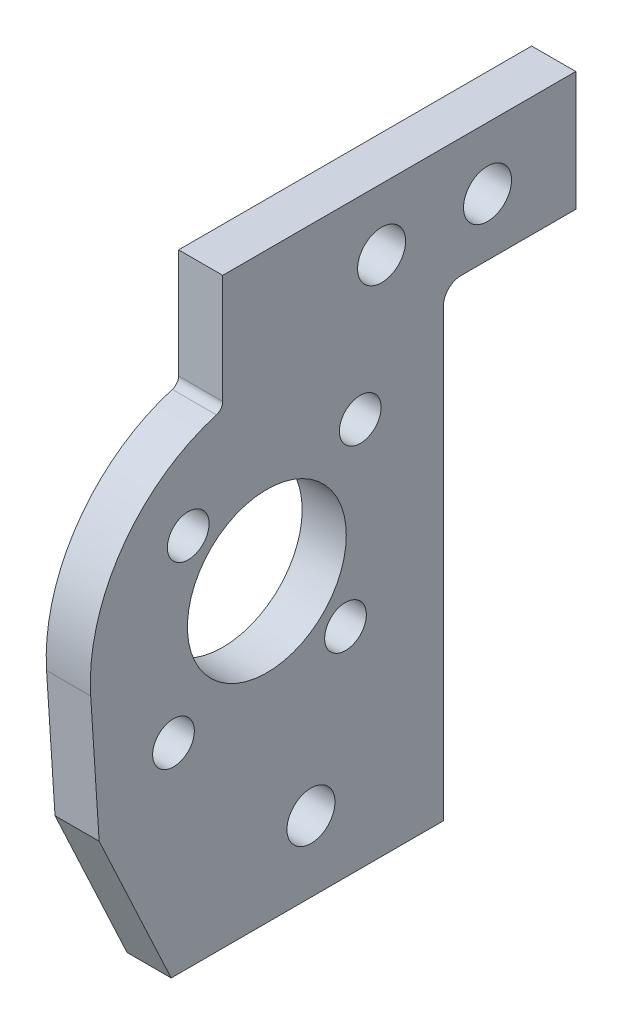
ISO-10303-21;
HEADER;
FILE_DESCRIPTION(('STEP AP214'),'2;1');
FILE_NAME('part.step','',(''),(''),'','','');
FILE_SCHEMA(('AUTOMOTIVE_DESIGN { 1 0 10303 214 1 1 1 1 }'));
ENDSEC;
DATA;
#1=APPLICATION_CONTEXT('core data for automotive mechanical design processes');
#2=APPLICATION_PROTOCOL_DEFINITION('international standard','automotive_design',2000,#1);
#3=PRODUCT_CONTEXT('',#1,'mechanical');
#4=PRODUCT('Part','Part','',(#3));
#5=PRODUCT_RELATED_PRODUCT_CATEGORY('part','',(#4));
#6=PRODUCT_DEFINITION_FORMATION('','',#4);
#7=PRODUCT_DEFINITION_CONTEXT('part definition',#1,'design');
#8=PRODUCT_DEFINITION('design','',#6,#7);
#9=PRODUCT_DEFINITION_SHAPE('','',#8);
#10=(LENGTH_UNIT() NAMED_UNIT(*) SI_UNIT(.MILLI.,.METRE.));
#11=(NAMED_UNIT(*) PLANE_ANGLE_UNIT() SI_UNIT($,.RADIAN.));
#12=(NAMED_UNIT(*) SI_UNIT($,.STERADIAN.) SOLID_ANGLE_UNIT());
#13=UNCERTAINTY_MEASURE_WITH_UNIT(LENGTH_MEASURE(1.E-05),#10,'distance_accuracy_value','');
#14=(GEOMETRIC_REPRESENTATION_CONTEXT(3) GLOBAL_UNCERTAINTY_ASSIGNED_CONTEXT((#13)) GLOBAL_UNIT_ASSIGNED_CONTEXT((#10,
#11,#12)) REPRESENTATION_CONTEXT('',''));
#15=CARTESIAN_POINT('',(0.,0.,0.));
#16=DIRECTION('',(0.,0.,1.));
#17=DIRECTION('',(1.,0.,0.));
#18=AXIS2_PLACEMENT_3D('',#15,#16,#17);
#19=CARTESIAN_POINT('',(12.7,33.3375,13.97));
#20=DIRECTION('',(-1.,0.,0.));
#21=DIRECTION('',(0.,0.,1.));
#22=AXIS2_PLACEMENT_3D('',#19,#20,#21);
#23=CYLINDRICAL_SURFACE('',#22,12.7);
#24=CARTESIAN_POINT('',(12.7,33.3375,13.97));
#25=DIRECTION('',(-1.,0.,0.));
#26=DIRECTION('',(0.,0.,1.));
#27=AXIS2_PLACEMENT_3D('',#24,#25,#26);
#28=CIRCLE('',#27,12.7);
#29=CARTESIAN_POINT('',(12.7,32.5131641528657,26.6432186287119));
#30=VERTEX_POINT('',#29);
#31=CARTESIAN_POINT('',(12.7,45.5080985632489,17.5985714285714));
#32=VERTEX_POINT('',#31);
#33=EDGE_CURVE('E128',#30,#32,#28,.T.);
#34=ORIENTED_EDGE('',*,*,#33,.T.);
#35=DIRECTION('',(-1.,0.,0.));
#36=VECTOR('',#35,1.);
#37=CARTESIAN_POINT('',(12.7,45.5080985632489,17.5985714285714));
#38=LINE('',#37,#36);
#39=CARTESIAN_POINT('',(9.525,45.5080985632489,17.5985714285714));
#40=VERTEX_POINT('',#39);
#41=EDGE_CURVE('E186',#32,#40,#38,.T.);
#42=ORIENTED_EDGE('',*,*,#41,.T.);
#43=CARTESIAN_POINT('',(9.525,33.3375,13.97));
#44=DIRECTION('',(-1.,0.,0.));
#45=DIRECTION('',(0.,0.,1.));
#46=AXIS2_PLACEMENT_3D('',#43,#44,#45);
#47=CIRCLE('',#46,12.7);
#48=CARTESIAN_POINT('',(9.525,32.5131641528657,26.6432186287119));
#49=VERTEX_POINT('',#48);
#50=EDGE_CURVE('E161',#49,#40,#47,.T.);
#51=ORIENTED_EDGE('',*,*,#50,.F.);
#52=DIRECTION('',(-1.,0.,0.));
#53=VECTOR('',#52,1.);
#54=CARTESIAN_POINT('',(12.7,32.5131641528657,26.6432186287119));
#55=LINE('',#54,#53);
#56=EDGE_CURVE('E184',#30,#49,#55,.T.);
#57=ORIENTED_EDGE('',*,*,#56,.F.);
#58=EDGE_LOOP('',(#34,#42,#51,#57));
#59=FACE_BOUND('',#58,.T.);
#60=ADVANCED_FACE('F35',(#59),#23,.T.);
#61=CARTESIAN_POINT('',(12.7,32.5131641528657,26.6432186287119));
#62=DIRECTION('',(0.,-0.0649083344200233,0.997891230607233));
#63=DIRECTION('',(0.,-0.997891230607233,-0.0649083344200233));
#64=AXIS2_PLACEMENT_3D('',#61,#62,#63);
#65=PLANE('',#64);
#66=DIRECTION('',(0.,0.997891230607233,0.0649083344200233));
#67=VECTOR('',#66,1.);
#68=CARTESIAN_POINT('',(9.525,32.5131641528657,26.6432186287119));
#69=LINE('',#68,#67);
#70=CARTESIAN_POINT('',(9.525,23.1625,26.035));
#71=VERTEX_POINT('',#70);
#72=EDGE_CURVE('E181',#71,#49,#69,.T.);
#73=ORIENTED_EDGE('',*,*,#72,.F.);
#74=DIRECTION('',(-1.,0.,0.));
#75=VECTOR('',#74,1.);
#76=CARTESIAN_POINT('',(12.7,23.1625,26.035));
#77=LINE('',#76,#75);
#78=CARTESIAN_POINT('',(12.7,23.1625,26.035));
#79=VERTEX_POINT('',#78);
#80=EDGE_CURVE('E187',#79,#71,#77,.T.);
#81=ORIENTED_EDGE('',*,*,#80,.F.);
#82=DIRECTION('',(0.,0.997891230607233,0.0649083344200233));
#83=VECTOR('',#82,1.);
#84=CARTESIAN_POINT('',(12.7,32.5131641528657,26.6432186287119));
#85=LINE('',#84,#83);
#86=EDGE_CURVE('E136',#79,#30,#85,.T.);
#87=ORIENTED_EDGE('',*,*,#86,.T.);
#88=ORIENTED_EDGE('',*,*,#56,.T.);
#89=EDGE_LOOP('',(#73,#81,#87,#88));
#90=FACE_BOUND('',#89,.T.);
#91=ADVANCED_FACE('F229',(#90),#65,.T.);
#92=CARTESIAN_POINT('',(12.7,23.1625,26.035));
#93=DIRECTION('',(0.,-0.422618261740703,0.906307787036648));
#94=DIRECTION('',(0.,-0.906307787036648,-0.422618261740703));
#95=AXIS2_PLACEMENT_3D('',#92,#93,#94);
#96=PLANE('',#95);
#97=DIRECTION('',(0.,0.906307787036648,0.422618261740703));
#98=VECTOR('',#97,1.);
#99=CARTESIAN_POINT('',(9.525,23.1625,26.035));
#100=LINE('',#99,#98);
#101=CARTESIAN_POINT('',(9.525,12.05,20.8531561487525));
#102=VERTEX_POINT('',#101);
#103=EDGE_CURVE('E178',#102,#71,#100,.T.);
#104=ORIENTED_EDGE('',*,*,#103,.F.);
#105=DIRECTION('',(-1.,0.,0.));
#106=VECTOR('',#105,1.);
#107=CARTESIAN_POINT('',(12.7,12.05,20.8531561487525));
#108=LINE('',#107,#106);
#109=CARTESIAN_POINT('',(12.7,12.05,20.8531561487525));
#110=VERTEX_POINT('',#109);
#111=EDGE_CURVE('E189',#110,#102,#108,.T.);
#112=ORIENTED_EDGE('',*,*,#111,.F.);
#113=DIRECTION('',(0.,0.906307787036648,0.422618261740703));
#114=VECTOR('',#113,1.);
#115=CARTESIAN_POINT('',(12.7,23.1625,26.035));
#116=LINE('',#115,#114);
#117=EDGE_CURVE('E156',#110,#79,#116,.T.);
#118=ORIENTED_EDGE('',*,*,#117,.T.);
#119=ORIENTED_EDGE('',*,*,#80,.T.);
#120=EDGE_LOOP('',(#104,#112,#118,#119));
#121=FACE_BOUND('',#120,.T.);
#122=ADVANCED_FACE('F235',(#121),#96,.T.);
#123=CARTESIAN_POINT('',(12.7,12.05,1.27000000000001));
#124=DIRECTION('',(0.,-1.,0.));
#125=DIRECTION('',(0.,0.,-1.));
#126=AXIS2_PLACEMENT_3D('',#123,#124,#125);
#127=PLANE('',#126);
#128=DIRECTION('',(0.,0.,1.));
#129=VECTOR('',#128,1.);
#130=CARTESIAN_POINT('',(9.525,12.05,1.27000000000001));
#131=LINE('',#130,#129);
#132=CARTESIAN_POINT('',(9.525,12.05,1.27000000000001));
#133=VERTEX_POINT('',#132);
#134=EDGE_CURVE('E175',#133,#102,#131,.T.);
#135=ORIENTED_EDGE('',*,*,#134,.F.);
#136=DIRECTION('',(-1.,0.,0.));
#137=VECTOR('',#136,1.);
#138=CARTESIAN_POINT('',(12.7,12.05,1.27000000000001));
#139=LINE('',#138,#137);
#140=CARTESIAN_POINT('',(12.7,12.05,1.27000000000001));
#141=VERTEX_POINT('',#140);
#142=EDGE_CURVE('E191',#141,#133,#139,.T.);
#143=ORIENTED_EDGE('',*,*,#142,.F.);
#144=DIRECTION('',(0.,0.,1.));
#145=VECTOR('',#144,1.);
#146=CARTESIAN_POINT('',(12.7,12.05,1.27000000000001));
#147=LINE('',#146,#145);
#148=EDGE_CURVE('E153',#141,#110,#147,.T.);
#149=ORIENTED_EDGE('',*,*,#148,.T.);
#150=ORIENTED_EDGE('',*,*,#111,.T.);
#151=EDGE_LOOP('',(#135,#143,#149,#150));
#152=FACE_BOUND('',#151,.T.);
#153=ADVANCED_FACE('F251',(#152),#127,.T.);
#154=CARTESIAN_POINT('',(12.7,12.05,1.27000000000001));
#155=DIRECTION('',(0.,0.,-1.));
#156=DIRECTION('',(0.,1.,0.));
#157=AXIS2_PLACEMENT_3D('',#154,#155,#156);
#158=PLANE('',#157);
#159=DIRECTION('',(0.,-1.,0.));
#160=VECTOR('',#159,1.);
#161=CARTESIAN_POINT('',(9.525,12.05,1.27000000000001));
#162=LINE('',#161,#160);
#163=CARTESIAN_POINT('',(9.525,44.1175,1.27000000000001));
#164=VERTEX_POINT('',#163);
#165=EDGE_CURVE('E173',#164,#133,#162,.T.);
#166=ORIENTED_EDGE('',*,*,#165,.F.);
#167=DIRECTION('',(-1.,0.,0.));
#168=VECTOR('',#167,1.);
#169=CARTESIAN_POINT('',(12.7,44.1175,1.27000000000001));
#170=LINE('',#169,#168);
#171=CARTESIAN_POINT('',(12.7,44.1175,1.27));
#172=VERTEX_POINT('',#171);
#173=EDGE_CURVE('E50',#164,#172,#170,.F.);
#174=ORIENTED_EDGE('',*,*,#173,.T.);
#175=DIRECTION('',(0.,-1.,0.));
#176=VECTOR('',#175,1.);
#177=CARTESIAN_POINT('',(12.7,45.3875,1.27));
#178=LINE('',#177,#176);
#179=EDGE_CURVE('E151',#172,#141,#178,.T.);
#180=ORIENTED_EDGE('',*,*,#179,.T.);
#181=ORIENTED_EDGE('',*,*,#142,.T.);
#182=EDGE_LOOP('',(#166,#174,#180,#181));
#183=FACE_BOUND('',#182,.T.);
#184=ADVANCED_FACE('F248',(#183),#158,.T.);
#185=CARTESIAN_POINT('',(12.7,45.3875,-8.25499999999999));
#186=DIRECTION('',(0.,-1.,0.));
#187=DIRECTION('',(0.,0.,-1.));
#188=AXIS2_PLACEMENT_3D('',#185,#186,#187);
#189=PLANE('',#188);
#190=DIRECTION('',(0.,0.,1.));
#191=VECTOR('',#190,1.);
#192=CARTESIAN_POINT('',(12.7,45.3875,-8.25499999999999));
#193=LINE('',#192,#191);
#194=CARTESIAN_POINT('',(12.7,45.3875,-8.25499999999999));
#195=VERTEX_POINT('',#194);
#196=CARTESIAN_POINT('',(12.7,45.3875,0.));
#197=VERTEX_POINT('',#196);
#198=EDGE_CURVE('E145',#195,#197,#193,.T.);
#199=ORIENTED_EDGE('',*,*,#198,.T.);
#200=DIRECTION('',(-1.,0.,0.));
#201=VECTOR('',#200,1.);
#202=CARTESIAN_POINT('',(9.525,45.3875,0.));
#203=LINE('',#202,#201);
#204=CARTESIAN_POINT('',(9.525,45.3875,0.));
#205=VERTEX_POINT('',#204);
#206=EDGE_CURVE('E207',#197,#205,#203,.T.);
#207=ORIENTED_EDGE('',*,*,#206,.T.);
#208=DIRECTION('',(0.,0.,1.));
#209=VECTOR('',#208,1.);
#210=CARTESIAN_POINT('',(9.525,45.3875,-8.25499999999999));
#211=LINE('',#210,#209);
#212=CARTESIAN_POINT('',(9.525,45.3875,-8.25499999999999));
#213=VERTEX_POINT('',#212);
#214=EDGE_CURVE('E171',#213,#205,#211,.T.);
#215=ORIENTED_EDGE('',*,*,#214,.F.);
#216=DIRECTION('',(-1.,0.,0.));
#217=VECTOR('',#216,1.);
#218=CARTESIAN_POINT('',(12.7,45.3875,-8.25499999999999));
#219=LINE('',#218,#217);
#220=EDGE_CURVE('E194',#195,#213,#219,.T.);
#221=ORIENTED_EDGE('',*,*,#220,.F.);
#222=EDGE_LOOP('',(#199,#207,#215,#221));
#223=FACE_BOUND('',#222,.T.);
#224=ADVANCED_FACE('F213',(#223),#189,.T.);
#225=CARTESIAN_POINT('',(12.7,53.975,-8.255));
#226=DIRECTION('',(0.,0.,-1.));
#227=DIRECTION('',(0.,1.,0.));
#228=AXIS2_PLACEMENT_3D('',#225,#226,#227);
#229=PLANE('',#228);
#230=DIRECTION('',(0.,-1.,0.));
#231=VECTOR('',#230,1.);
#232=CARTESIAN_POINT('',(9.525,53.975,-8.255));
#233=LINE('',#232,#231);
#234=CARTESIAN_POINT('',(9.525,53.975,-8.255));
#235=VERTEX_POINT('',#234);
#236=EDGE_CURVE('E168',#235,#213,#233,.T.);
#237=ORIENTED_EDGE('',*,*,#236,.F.);
#238=DIRECTION('',(-1.,0.,0.));
#239=VECTOR('',#238,1.);
#240=CARTESIAN_POINT('',(12.7,53.975,-8.255));
#241=LINE('',#240,#239);
#242=CARTESIAN_POINT('',(12.7,53.975,-8.255));
#243=VERTEX_POINT('',#242);
#244=EDGE_CURVE('E135',#243,#235,#241,.T.);
#245=ORIENTED_EDGE('',*,*,#244,.F.);
#246=DIRECTION('',(0.,-1.,0.));
#247=VECTOR('',#246,1.);
#248=CARTESIAN_POINT('',(12.7,53.975,-8.255));
#249=LINE('',#248,#247);
#250=EDGE_CURVE('E143',#243,#195,#249,.T.);
#251=ORIENTED_EDGE('',*,*,#250,.T.);
#252=ORIENTED_EDGE('',*,*,#220,.T.);
#253=EDGE_LOOP('',(#237,#245,#251,#252));
#254=FACE_BOUND('',#253,.T.);
#255=ADVANCED_FACE('F219',(#254),#229,.T.);
#256=CARTESIAN_POINT('',(12.7,53.975,17.145));
#257=DIRECTION('',(0.,1.,0.));
#258=DIRECTION('',(0.,0.,1.));
#259=AXIS2_PLACEMENT_3D('',#256,#257,#258);
#260=PLANE('',#259);
#261=DIRECTION('',(0.,0.,-1.));
#262=VECTOR('',#261,1.);
#263=CARTESIAN_POINT('',(9.525,53.975,17.145));
#264=LINE('',#263,#262);
#265=CARTESIAN_POINT('',(9.525,53.975,17.145));
#266=VERTEX_POINT('',#265);
#267=EDGE_CURVE('E134',#266,#235,#264,.T.);
#268=ORIENTED_EDGE('',*,*,#267,.F.);
#269=DIRECTION('',(-1.,0.,0.));
#270=VECTOR('',#269,1.);
#271=CARTESIAN_POINT('',(12.7,53.975,17.145));
#272=LINE('',#271,#270);
#273=CARTESIAN_POINT('',(12.7,53.975,17.145));
#274=VERTEX_POINT('',#273);
#275=EDGE_CURVE('E120',#274,#266,#272,.T.);
#276=ORIENTED_EDGE('',*,*,#275,.F.);
#277=DIRECTION('',(0.,0.,-1.));
#278=VECTOR('',#277,1.);
#279=CARTESIAN_POINT('',(12.7,53.975,17.145));
#280=LINE('',#279,#278);
#281=EDGE_CURVE('E127',#274,#243,#280,.T.);
#282=ORIENTED_EDGE('',*,*,#281,.T.);
#283=ORIENTED_EDGE('',*,*,#244,.T.);
#284=EDGE_LOOP('',(#268,#276,#282,#283));
#285=FACE_BOUND('',#284,.T.);
#286=ADVANCED_FACE('F132',(#285),#260,.T.);
#287=CARTESIAN_POINT('',(12.7,45.6342221242085,17.145));
#288=DIRECTION('',(0.,0.,1.));
#289=DIRECTION('',(1.,0.,0.));
#290=AXIS2_PLACEMENT_3D('',#287,#288,#289);
#291=PLANE('',#290);
#292=DIRECTION('',(0.,1.,0.));
#293=VECTOR('',#292,1.);
#294=CARTESIAN_POINT('',(9.525,45.6342221242085,17.145));
#295=LINE('',#294,#293);
#296=CARTESIAN_POINT('',(9.525,46.1166284914113,17.145));
#297=VERTEX_POINT('',#296);
#298=EDGE_CURVE('E164',#297,#266,#295,.T.);
#299=ORIENTED_EDGE('',*,*,#298,.F.);
#300=DIRECTION('',(1.,0.,0.));
#301=VECTOR('',#300,1.);
#302=CARTESIAN_POINT('',(12.7,46.1166284914113,17.145));
#303=LINE('',#302,#301);
#304=CARTESIAN_POINT('',(12.7,46.1166284914113,17.145));
#305=VERTEX_POINT('',#304);
#306=EDGE_CURVE('E123',#297,#305,#303,.T.);
#307=ORIENTED_EDGE('',*,*,#306,.T.);
#308=DIRECTION('',(0.,1.,0.));
#309=VECTOR('',#308,1.);
#310=CARTESIAN_POINT('',(12.7,45.6342221242085,17.145));
#311=LINE('',#310,#309);
#312=EDGE_CURVE('E116',#305,#274,#311,.T.);
#313=ORIENTED_EDGE('',*,*,#312,.T.);
#314=ORIENTED_EDGE('',*,*,#275,.T.);
#315=EDGE_LOOP('',(#299,#307,#313,#314));
#316=FACE_BOUND('',#315,.T.);
#317=ADVANCED_FACE('F119',(#316),#291,.T.);
#318=CARTESIAN_POINT('',(12.7,33.3375,13.97));
#319=DIRECTION('',(-1.,0.,0.));
#320=DIRECTION('',(0.,0.,1.));
#321=AXIS2_PLACEMENT_3D('',#318,#319,#320);
#322=PLANE('',#321);
#323=CARTESIAN_POINT('',(12.7,17.13,10.795));
#324=DIRECTION('',(-1.,0.,0.));
#325=DIRECTION('',(0.,0.,1.));
#326=AXIS2_PLACEMENT_3D('',#323,#324,#325);
#327=CIRCLE('',#326,1.7272);
#328=CARTESIAN_POINT('',(12.7,17.13,12.5222));
#329=VERTEX_POINT('',#328);
#330=EDGE_CURVE('E302',#329,#329,#327,.T.);
#331=ORIENTED_EDGE('',*,*,#330,.T.);
#332=EDGE_LOOP('',(#331));
#333=FACE_BOUND('',#332,.T.);
#334=CARTESIAN_POINT('',(12.7,49.53,-1.90499999999999));
#335=DIRECTION('',(-1.,0.,0.));
#336=DIRECTION('',(0.,0.,1.));
#337=AXIS2_PLACEMENT_3D('',#334,#335,#336);
#338=CIRCLE('',#337,1.72720000000001);
#339=CARTESIAN_POINT('',(12.7,49.53,-0.177799999999987));
#340=VERTEX_POINT('',#339);
#341=EDGE_CURVE('E304',#340,#340,#338,.T.);
#342=ORIENTED_EDGE('',*,*,#341,.T.);
#343=EDGE_LOOP('',(#342));
#344=FACE_BOUND('',#343,.T.);
#345=CARTESIAN_POINT('',(12.7,49.53,5.71500000000001));
#346=DIRECTION('',(-1.,0.,0.));
#347=DIRECTION('',(0.,0.,1.));
#348=AXIS2_PLACEMENT_3D('',#345,#346,#347);
#349=CIRCLE('',#348,1.72720000000001);
#350=CARTESIAN_POINT('',(12.7,49.53,7.44220000000001));
#351=VERTEX_POINT('',#350);
#352=EDGE_CURVE('E310',#351,#351,#349,.T.);
#353=ORIENTED_EDGE('',*,*,#352,.T.);
#354=EDGE_LOOP('',(#353));
#355=FACE_BOUND('',#354,.T.);
#356=CARTESIAN_POINT('',(12.7,26.6199855787278,20.6875144212722));
#357=DIRECTION('',(-1.,0.,0.));
#358=DIRECTION('',(0.,0.,1.));
#359=AXIS2_PLACEMENT_3D('',#356,#357,#358);
#360=CIRCLE('',#359,1.49999999999994);
#361=CARTESIAN_POINT('',(12.7,26.6199855787278,22.1875144212722));
#362=VERTEX_POINT('',#361);
#363=EDGE_CURVE('E317',#362,#362,#360,.F.);
#364=ORIENTED_EDGE('',*,*,#363,.F.);
#365=EDGE_LOOP('',(#364));
#366=FACE_BOUND('',#365,.T.);
#367=CARTESIAN_POINT('',(12.7,38.9943542494923,19.6268542494924));
#368=DIRECTION('',(-1.,0.,0.));
#369=DIRECTION('',(0.,0.,1.));
#370=AXIS2_PLACEMENT_3D('',#367,#368,#369);
#371=CIRCLE('',#370,1.49999999999999);
#372=CARTESIAN_POINT('',(12.7,38.9943542494923,21.1268542494924));
#373=VERTEX_POINT('',#372);
#374=EDGE_CURVE('E318',#373,#373,#371,.F.);
#375=ORIENTED_EDGE('',*,*,#374,.F.);
#376=EDGE_LOOP('',(#375));
#377=FACE_BOUND('',#376,.T.);
#378=CARTESIAN_POINT('',(12.7,40.0550144212723,7.2524855787279));
#379=DIRECTION('',(-1.,0.,0.));
#380=DIRECTION('',(0.,0.,1.));
#381=AXIS2_PLACEMENT_3D('',#378,#379,#380);
#382=CIRCLE('',#381,1.49999999999993);
#383=CARTESIAN_POINT('',(12.7,40.0550144212723,8.75248557872783));
#384=VERTEX_POINT('',#383);
#385=EDGE_CURVE('E324',#384,#384,#382,.F.);
#386=ORIENTED_EDGE('',*,*,#385,.F.);
#387=EDGE_LOOP('',(#386));
#388=FACE_BOUND('',#387,.T.);
#389=CARTESIAN_POINT('',(12.7,27.6806457505076,8.3131457505076));
#390=DIRECTION('',(-1.,0.,0.));
#391=DIRECTION('',(0.,0.,1.));
#392=AXIS2_PLACEMENT_3D('',#389,#390,#391);
#393=CIRCLE('',#392,1.5);
#394=CARTESIAN_POINT('',(12.7,27.6806457505076,9.81314575050759));
#395=VERTEX_POINT('',#394);
#396=EDGE_CURVE('E307',#395,#395,#393,.F.);
#397=ORIENTED_EDGE('',*,*,#396,.F.);
#398=EDGE_LOOP('',(#397));
#399=FACE_BOUND('',#398,.T.);
#400=CARTESIAN_POINT('',(12.7,33.3375,13.97));
#401=DIRECTION('',(1.,0.,0.));
#402=DIRECTION('',(0.,0.,-1.));
#403=AXIS2_PLACEMENT_3D('',#400,#401,#402);
#404=CIRCLE('',#403,5.715);
#405=CARTESIAN_POINT('',(12.7,33.3375,8.25500000000001));
#406=VERTEX_POINT('',#405);
#407=EDGE_CURVE('E199',#406,#406,#404,.T.);
#408=ORIENTED_EDGE('',*,*,#407,.F.);
#409=EDGE_LOOP('',(#408));
#410=FACE_BOUND('',#409,.T.);
#411=ORIENTED_EDGE('',*,*,#33,.F.);
#412=ORIENTED_EDGE('',*,*,#86,.F.);
#413=ORIENTED_EDGE('',*,*,#117,.F.);
#414=ORIENTED_EDGE('',*,*,#148,.F.);
#415=ORIENTED_EDGE('',*,*,#179,.F.);
#416=CARTESIAN_POINT('',(12.7,44.1175,0.));
#417=DIRECTION('',(-1.,0.,0.));
#418=DIRECTION('',(0.,0.,1.));
#419=AXIS2_PLACEMENT_3D('',#416,#417,#418);
#420=CIRCLE('',#419,1.27);
#421=EDGE_CURVE('E11',#172,#197,#420,.T.);
#422=ORIENTED_EDGE('',*,*,#421,.T.);
#423=ORIENTED_EDGE('',*,*,#198,.F.);
#424=ORIENTED_EDGE('',*,*,#250,.F.);
#425=ORIENTED_EDGE('',*,*,#281,.F.);
#426=ORIENTED_EDGE('',*,*,#312,.F.);
#427=CARTESIAN_POINT('',(12.7,46.1166284914113,17.78));
#428=DIRECTION('',(-1.,0.,0.));
#429=DIRECTION('',(0.,0.,1.));
#430=AXIS2_PLACEMENT_3D('',#427,#428,#429);
#431=CIRCLE('',#430,0.635);
#432=EDGE_CURVE('E205',#305,#32,#431,.T.);
#433=ORIENTED_EDGE('',*,*,#432,.T.);
#434=EDGE_LOOP('',(#411,#412,#413,#414,#415,#422,#423,#424,#425,#426,#433));
#435=FACE_BOUND('',#434,.T.);
#436=ADVANCED_FACE('F140',(#333,#344,#355,#366,#377,#388,#399,#410,#435),#322,.F.);
#437=CARTESIAN_POINT('',(9.525,33.3375,13.97));
#438=DIRECTION('',(-1.,0.,0.));
#439=DIRECTION('',(0.,0.,1.));
#440=AXIS2_PLACEMENT_3D('',#437,#438,#439);
#441=PLANE('',#440);
#442=CARTESIAN_POINT('',(9.525,17.13,10.795));
#443=DIRECTION('',(-1.,0.,0.));
#444=DIRECTION('',(0.,0.,1.));
#445=AXIS2_PLACEMENT_3D('',#442,#443,#444);
#446=CIRCLE('',#445,1.7272);
#447=CARTESIAN_POINT('',(9.525,17.13,12.5222));
#448=VERTEX_POINT('',#447);
#449=EDGE_CURVE('E299',#448,#448,#446,.T.);
#450=ORIENTED_EDGE('',*,*,#449,.F.);
#451=EDGE_LOOP('',(#450));
#452=FACE_BOUND('',#451,.T.);
#453=CARTESIAN_POINT('',(9.525,49.53,-1.90499999999999));
#454=DIRECTION('',(-1.,0.,0.));
#455=DIRECTION('',(0.,0.,1.));
#456=AXIS2_PLACEMENT_3D('',#453,#454,#455);
#457=CIRCLE('',#456,1.72720000000001);
#458=CARTESIAN_POINT('',(9.525,49.53,-0.177799999999987));
#459=VERTEX_POINT('',#458);
#460=EDGE_CURVE('E373',#459,#459,#457,.T.);
#461=ORIENTED_EDGE('',*,*,#460,.F.);
#462=EDGE_LOOP('',(#461));
#463=FACE_BOUND('',#462,.T.);
#464=CARTESIAN_POINT('',(9.525,49.53,5.71500000000001));
#465=DIRECTION('',(-1.,0.,0.));
#466=DIRECTION('',(0.,0.,1.));
#467=AXIS2_PLACEMENT_3D('',#464,#465,#466);
#468=CIRCLE('',#467,1.72720000000001);
#469=CARTESIAN_POINT('',(9.525,49.53,7.44220000000001));
#470=VERTEX_POINT('',#469);
#471=EDGE_CURVE('E370',#470,#470,#468,.T.);
#472=ORIENTED_EDGE('',*,*,#471,.F.);
#473=EDGE_LOOP('',(#472));
#474=FACE_BOUND('',#473,.T.);
#475=CARTESIAN_POINT('',(9.525,26.6199855787278,20.6875144212722));
#476=DIRECTION('',(-1.,0.,0.));
#477=DIRECTION('',(0.,0.,1.));
#478=AXIS2_PLACEMENT_3D('',#475,#476,#477);
#479=CIRCLE('',#478,1.49999999999994);
#480=CARTESIAN_POINT('',(9.525,26.6199855787278,22.1875144212722));
#481=VERTEX_POINT('',#480);
#482=EDGE_CURVE('E314',#481,#481,#479,.T.);
#483=ORIENTED_EDGE('',*,*,#482,.F.);
#484=EDGE_LOOP('',(#483));
#485=FACE_BOUND('',#484,.T.);
#486=CARTESIAN_POINT('',(9.525,38.9943542494923,19.6268542494924));
#487=DIRECTION('',(-1.,0.,0.));
#488=DIRECTION('',(0.,0.,1.));
#489=AXIS2_PLACEMENT_3D('',#486,#487,#488);
#490=CIRCLE('',#489,1.49999999999999);
#491=CARTESIAN_POINT('',(9.525,38.9943542494923,21.1268542494924));
#492=VERTEX_POINT('',#491);
#493=EDGE_CURVE('E321',#492,#492,#490,.T.);
#494=ORIENTED_EDGE('',*,*,#493,.F.);
#495=EDGE_LOOP('',(#494));
#496=FACE_BOUND('',#495,.T.);
#497=CARTESIAN_POINT('',(9.525,40.0550144212723,7.2524855787279));
#498=DIRECTION('',(-1.,0.,0.));
#499=DIRECTION('',(0.,0.,1.));
#500=AXIS2_PLACEMENT_3D('',#497,#498,#499);
#501=CIRCLE('',#500,1.49999999999993);
#502=CARTESIAN_POINT('',(9.525,40.0550144212723,8.75248557872783));
#503=VERTEX_POINT('',#502);
#504=EDGE_CURVE('E327',#503,#503,#501,.T.);
#505=ORIENTED_EDGE('',*,*,#504,.F.);
#506=EDGE_LOOP('',(#505));
#507=FACE_BOUND('',#506,.T.);
#508=CARTESIAN_POINT('',(9.525,27.6806457505076,8.3131457505076));
#509=DIRECTION('',(-1.,0.,0.));
#510=DIRECTION('',(0.,0.,1.));
#511=AXIS2_PLACEMENT_3D('',#508,#509,#510);
#512=CIRCLE('',#511,1.5);
#513=CARTESIAN_POINT('',(9.525,27.6806457505076,9.81314575050759));
#514=VERTEX_POINT('',#513);
#515=EDGE_CURVE('E303',#514,#514,#512,.T.);
#516=ORIENTED_EDGE('',*,*,#515,.F.);
#517=EDGE_LOOP('',(#516));
#518=FACE_BOUND('',#517,.T.);
#519=CARTESIAN_POINT('',(9.525,33.3375,13.97));
#520=DIRECTION('',(-1.,0.,0.));
#521=DIRECTION('',(0.,0.,1.));
#522=AXIS2_PLACEMENT_3D('',#519,#520,#521);
#523=CIRCLE('',#522,5.715);
#524=CARTESIAN_POINT('',(9.525,33.3375,19.685));
#525=VERTEX_POINT('',#524);
#526=EDGE_CURVE('E165',#525,#525,#523,.T.);
#527=ORIENTED_EDGE('',*,*,#526,.F.);
#528=EDGE_LOOP('',(#527));
#529=FACE_BOUND('',#528,.T.);
#530=ORIENTED_EDGE('',*,*,#50,.T.);
#531=CARTESIAN_POINT('',(9.525,46.1166284914113,17.78));
#532=DIRECTION('',(-1.,0.,0.));
#533=DIRECTION('',(0.,0.,1.));
#534=AXIS2_PLACEMENT_3D('',#531,#532,#533);
#535=CIRCLE('',#534,0.635);
#536=EDGE_CURVE('E203',#40,#297,#535,.F.);
#537=ORIENTED_EDGE('',*,*,#536,.T.);
#538=ORIENTED_EDGE('',*,*,#298,.T.);
#539=ORIENTED_EDGE('',*,*,#267,.T.);
#540=ORIENTED_EDGE('',*,*,#236,.T.);
#541=ORIENTED_EDGE('',*,*,#214,.T.);
#542=CARTESIAN_POINT('',(9.525,44.1175,0.));
#543=DIRECTION('',(-1.,0.,0.));
#544=DIRECTION('',(0.,0.,1.));
#545=AXIS2_PLACEMENT_3D('',#542,#543,#544);
#546=CIRCLE('',#545,1.27);
#547=EDGE_CURVE('E43',#205,#164,#546,.F.);
#548=ORIENTED_EDGE('',*,*,#547,.T.);
#549=ORIENTED_EDGE('',*,*,#165,.T.);
#550=ORIENTED_EDGE('',*,*,#134,.T.);
#551=ORIENTED_EDGE('',*,*,#103,.T.);
#552=ORIENTED_EDGE('',*,*,#72,.T.);
#553=EDGE_LOOP('',(#530,#537,#538,#539,#540,#541,#548,#549,#550,#551,#552));
#554=FACE_BOUND('',#553,.T.);
#555=ADVANCED_FACE('F216',(#452,#463,#474,#485,#496,#507,#518,#529,#554),#441,.T.);
#556=CARTESIAN_POINT('',(0.,33.3375,13.97));
#557=DIRECTION('',(1.,0.,0.));
#558=DIRECTION('',(0.,0.,-1.));
#559=AXIS2_PLACEMENT_3D('',#556,#557,#558);
#560=CYLINDRICAL_SURFACE('',#559,5.715);
#561=ORIENTED_EDGE('',*,*,#526,.T.);
#562=EDGE_LOOP('',(#561));
#563=FACE_BOUND('',#562,.T.);
#564=ORIENTED_EDGE('',*,*,#407,.T.);
#565=EDGE_LOOP('',(#564));
#566=FACE_BOUND('',#565,.T.);
#567=ADVANCED_FACE('F260',(#563,#566),#560,.F.);
#568=CARTESIAN_POINT('',(32.501,27.6806457505076,8.3131457505076));
#569=DIRECTION('',(-1.,0.,0.));
#570=DIRECTION('',(0.,0.,1.));
#571=AXIS2_PLACEMENT_3D('',#568,#569,#570);
#572=CYLINDRICAL_SURFACE('',#571,1.5);
#573=ORIENTED_EDGE('',*,*,#515,.T.);
#574=EDGE_LOOP('',(#573));
#575=FACE_BOUND('',#574,.T.);
#576=ORIENTED_EDGE('',*,*,#396,.T.);
#577=EDGE_LOOP('',(#576));
#578=FACE_BOUND('',#577,.T.);
#579=ADVANCED_FACE('F267',(#575,#578),#572,.F.);
#580=CARTESIAN_POINT('',(32.501,40.0550144212723,7.2524855787279));
#581=DIRECTION('',(-1.,0.,0.));
#582=DIRECTION('',(0.,0.,1.));
#583=AXIS2_PLACEMENT_3D('',#580,#581,#582);
#584=CYLINDRICAL_SURFACE('',#583,1.49999999999993);
#585=ORIENTED_EDGE('',*,*,#504,.T.);
#586=EDGE_LOOP('',(#585));
#587=FACE_BOUND('',#586,.T.);
#588=ORIENTED_EDGE('',*,*,#385,.T.);
#589=EDGE_LOOP('',(#588));
#590=FACE_BOUND('',#589,.T.);
#591=ADVANCED_FACE('F271',(#587,#590),#584,.F.);
#592=CARTESIAN_POINT('',(32.501,38.9943542494923,19.6268542494924));
#593=DIRECTION('',(-1.,0.,0.));
#594=DIRECTION('',(0.,0.,1.));
#595=AXIS2_PLACEMENT_3D('',#592,#593,#594);
#596=CYLINDRICAL_SURFACE('',#595,1.49999999999999);
#597=ORIENTED_EDGE('',*,*,#493,.T.);
#598=EDGE_LOOP('',(#597));
#599=FACE_BOUND('',#598,.T.);
#600=ORIENTED_EDGE('',*,*,#374,.T.);
#601=EDGE_LOOP('',(#600));
#602=FACE_BOUND('',#601,.T.);
#603=ADVANCED_FACE('F275',(#599,#602),#596,.F.);
#604=CARTESIAN_POINT('',(32.501,26.6199855787278,20.6875144212722));
#605=DIRECTION('',(-1.,0.,0.));
#606=DIRECTION('',(0.,0.,1.));
#607=AXIS2_PLACEMENT_3D('',#604,#605,#606);
#608=CYLINDRICAL_SURFACE('',#607,1.49999999999994);
#609=ORIENTED_EDGE('',*,*,#482,.T.);
#610=EDGE_LOOP('',(#609));
#611=FACE_BOUND('',#610,.T.);
#612=ORIENTED_EDGE('',*,*,#363,.T.);
#613=EDGE_LOOP('',(#612));
#614=FACE_BOUND('',#613,.T.);
#615=ADVANCED_FACE('F279',(#611,#614),#608,.F.);
#616=CARTESIAN_POINT('',(32.5,49.53,5.71500000000001));
#617=DIRECTION('',(-1.,0.,0.));
#618=DIRECTION('',(0.,0.,1.));
#619=AXIS2_PLACEMENT_3D('',#616,#617,#618);
#620=CYLINDRICAL_SURFACE('',#619,1.72720000000001);
#621=ORIENTED_EDGE('',*,*,#471,.T.);
#622=EDGE_LOOP('',(#621));
#623=FACE_BOUND('',#622,.T.);
#624=ORIENTED_EDGE('',*,*,#352,.F.);
#625=EDGE_LOOP('',(#624));
#626=FACE_BOUND('',#625,.T.);
#627=ADVANCED_FACE('F283',(#623,#626),#620,.F.);
#628=CARTESIAN_POINT('',(32.5,49.53,-1.90499999999999));
#629=DIRECTION('',(-1.,0.,0.));
#630=DIRECTION('',(0.,0.,1.));
#631=AXIS2_PLACEMENT_3D('',#628,#629,#630);
#632=CYLINDRICAL_SURFACE('',#631,1.72720000000001);
#633=ORIENTED_EDGE('',*,*,#460,.T.);
#634=EDGE_LOOP('',(#633));
#635=FACE_BOUND('',#634,.T.);
#636=ORIENTED_EDGE('',*,*,#341,.F.);
#637=EDGE_LOOP('',(#636));
#638=FACE_BOUND('',#637,.T.);
#639=ADVANCED_FACE('F287',(#635,#638),#632,.F.);
#640=CARTESIAN_POINT('',(32.5,17.13,10.795));
#641=DIRECTION('',(-1.,0.,0.));
#642=DIRECTION('',(0.,0.,1.));
#643=AXIS2_PLACEMENT_3D('',#640,#641,#642);
#644=CYLINDRICAL_SURFACE('',#643,1.7272);
#645=ORIENTED_EDGE('',*,*,#449,.T.);
#646=EDGE_LOOP('',(#645));
#647=FACE_BOUND('',#646,.T.);
#648=ORIENTED_EDGE('',*,*,#330,.F.);
#649=EDGE_LOOP('',(#648));
#650=FACE_BOUND('',#649,.T.);
#651=ADVANCED_FACE('F226',(#647,#650),#644,.F.);
#652=CARTESIAN_POINT('',(12.7,46.1166284914113,17.78));
#653=DIRECTION('',(-1.,0.,0.));
#654=DIRECTION('',(0.,0.,1.));
#655=AXIS2_PLACEMENT_3D('',#652,#653,#654);
#656=CYLINDRICAL_SURFACE('',#655,0.635);
#657=ORIENTED_EDGE('',*,*,#432,.F.);
#658=ORIENTED_EDGE('',*,*,#306,.F.);
#659=ORIENTED_EDGE('',*,*,#536,.F.);
#660=ORIENTED_EDGE('',*,*,#41,.F.);
#661=EDGE_LOOP('',(#657,#658,#659,#660));
#662=FACE_BOUND('',#661,.T.);
#663=ADVANCED_FACE('F222',(#662),#656,.F.);
#664=CARTESIAN_POINT('',(12.7,44.1175,0.));
#665=DIRECTION('',(1.,0.,0.));
#666=DIRECTION('',(0.,0.,-1.));
#667=AXIS2_PLACEMENT_3D('',#664,#665,#666);
#668=CYLINDRICAL_SURFACE('',#667,1.27);
#669=ORIENTED_EDGE('',*,*,#421,.F.);
#670=ORIENTED_EDGE('',*,*,#173,.F.);
#671=ORIENTED_EDGE('',*,*,#547,.F.);
#672=ORIENTED_EDGE('',*,*,#206,.F.);
#673=EDGE_LOOP('',(#669,#670,#671,#672));
#674=FACE_BOUND('',#673,.T.);
#675=ADVANCED_FACE('F37',(#674),#668,.F.);
#676=CLOSED_SHELL('',(#60,#91,#122,#153,#184,#224,#255,#286,#317,#436,#555,#567,#579,#591,#603,
#615,#627,#639,#651,#663,#675));
#677=MANIFOLD_SOLID_BREP('B2',#676);
#678=ADVANCED_BREP_SHAPE_REPRESENTATION('',(#18,#677),#14);
#679=SHAPE_DEFINITION_REPRESENTATION(#9,#678);
ENDSEC;
END-ISO-10303-21;
